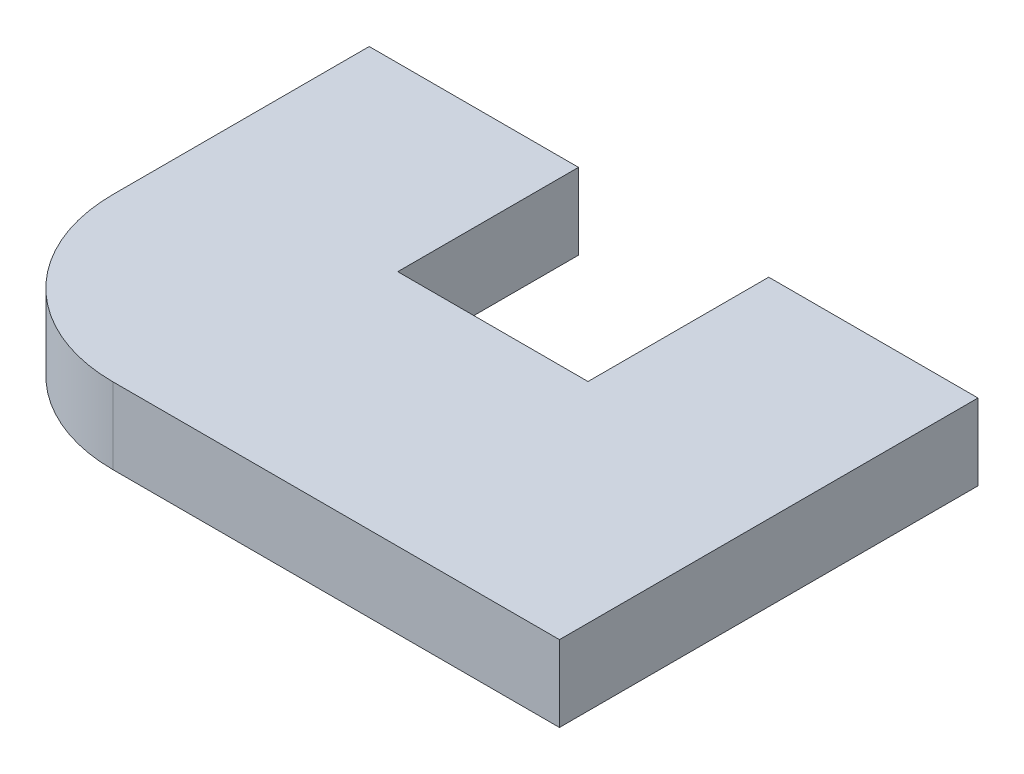
ISO-10303-21;
HEADER;
FILE_DESCRIPTION(('STEP AP214'),'2;1');
FILE_NAME('part.step','',(''),(''),'','','');
FILE_SCHEMA(('AUTOMOTIVE_DESIGN { 1 0 10303 214 1 1 1 1 }'));
ENDSEC;
DATA;
#1=APPLICATION_CONTEXT('core data for automotive mechanical design processes');
#2=APPLICATION_PROTOCOL_DEFINITION('international standard','automotive_design',2000,#1);
#3=PRODUCT_CONTEXT('',#1,'mechanical');
#4=PRODUCT('Part','Part','',(#3));
#5=PRODUCT_RELATED_PRODUCT_CATEGORY('part','',(#4));
#6=PRODUCT_DEFINITION_FORMATION('','',#4);
#7=PRODUCT_DEFINITION_CONTEXT('part definition',#1,'design');
#8=PRODUCT_DEFINITION('design','',#6,#7);
#9=PRODUCT_DEFINITION_SHAPE('','',#8);
#10=(LENGTH_UNIT() NAMED_UNIT(*) SI_UNIT(.MILLI.,.METRE.));
#11=(NAMED_UNIT(*) PLANE_ANGLE_UNIT() SI_UNIT($,.RADIAN.));
#12=(NAMED_UNIT(*) SI_UNIT($,.STERADIAN.) SOLID_ANGLE_UNIT());
#13=UNCERTAINTY_MEASURE_WITH_UNIT(LENGTH_MEASURE(1.E-05),#10,'distance_accuracy_value','');
#14=(GEOMETRIC_REPRESENTATION_CONTEXT(3) GLOBAL_UNCERTAINTY_ASSIGNED_CONTEXT((#13)) GLOBAL_UNIT_ASSIGNED_CONTEXT((#10,
#11,#12)) REPRESENTATION_CONTEXT('',''));
#15=CARTESIAN_POINT('',(0.,0.,0.));
#16=DIRECTION('',(0.,0.,1.));
#17=DIRECTION('',(1.,0.,0.));
#18=AXIS2_PLACEMENT_3D('',#15,#16,#17);
#19=CARTESIAN_POINT('',(30.3553390593274,40.,24.6446609406726));
#20=DIRECTION('',(0.,-1.,0.));
#21=DIRECTION('',(0.,0.,-1.));
#22=AXIS2_PLACEMENT_3D('',#19,#20,#21);
#23=CYLINDRICAL_SURFACE('',#22,85.3553390593274);
#24=CARTESIAN_POINT('',(30.3553390593274,0.,24.6446609406726));
#25=DIRECTION('',(0.,1.,0.));
#26=DIRECTION('',(0.,0.,1.));
#27=AXIS2_PLACEMENT_3D('',#24,#25,#26);
#28=CIRCLE('',#27,85.3553390593274);
#29=CARTESIAN_POINT('',(30.3553390593274,0.,110.));
#30=VERTEX_POINT('',#29);
#31=CARTESIAN_POINT('',(-55.,0.,24.6446609406726));
#32=VERTEX_POINT('',#31);
#33=EDGE_CURVE('E146',#30,#32,#28,.F.);
#34=ORIENTED_EDGE('',*,*,#33,.F.);
#35=DIRECTION('',(0.,-1.,0.));
#36=VECTOR('',#35,1.);
#37=CARTESIAN_POINT('',(30.3553390593274,40.,110.));
#38=LINE('',#37,#36);
#39=CARTESIAN_POINT('',(30.3553390593274,40.,110.));
#40=VERTEX_POINT('',#39);
#41=EDGE_CURVE('E11',#40,#30,#38,.T.);
#42=ORIENTED_EDGE('',*,*,#41,.F.);
#43=CARTESIAN_POINT('',(30.3553390593274,40.,24.6446609406726));
#44=DIRECTION('',(0.,1.,0.));
#45=DIRECTION('',(0.,0.,1.));
#46=AXIS2_PLACEMENT_3D('',#43,#44,#45);
#47=CIRCLE('',#46,85.3553390593274);
#48=CARTESIAN_POINT('',(-55.,40.,24.6446609406726));
#49=VERTEX_POINT('',#48);
#50=EDGE_CURVE('E168',#40,#49,#47,.F.);
#51=ORIENTED_EDGE('',*,*,#50,.T.);
#52=DIRECTION('',(0.,-1.,0.));
#53=VECTOR('',#52,1.);
#54=CARTESIAN_POINT('',(-55.,40.,24.6446609406726));
#55=LINE('',#54,#53);
#56=EDGE_CURVE('E62',#49,#32,#55,.T.);
#57=ORIENTED_EDGE('',*,*,#56,.T.);
#58=EDGE_LOOP('',(#34,#42,#51,#57));
#59=FACE_BOUND('',#58,.T.);
#60=ADVANCED_FACE('F46',(#59),#23,.T.);
#61=CARTESIAN_POINT('',(0.,40.,110.));
#62=DIRECTION('',(0.,0.,-1.));
#63=DIRECTION('',(-1.,0.,0.));
#64=AXIS2_PLACEMENT_3D('',#61,#62,#63);
#65=PLANE('',#64);
#66=DIRECTION('',(1.,0.,0.));
#67=VECTOR('',#66,1.);
#68=CARTESIAN_POINT('',(0.,0.,110.));
#69=LINE('',#68,#67);
#70=CARTESIAN_POINT('',(265.,0.,110.));
#71=VERTEX_POINT('',#70);
#72=EDGE_CURVE('E148',#30,#71,#69,.T.);
#73=ORIENTED_EDGE('',*,*,#72,.T.);
#74=DIRECTION('',(0.,-1.,0.));
#75=VECTOR('',#74,1.);
#76=CARTESIAN_POINT('',(265.,40.,110.));
#77=LINE('',#76,#75);
#78=CARTESIAN_POINT('',(265.,40.,110.));
#79=VERTEX_POINT('',#78);
#80=EDGE_CURVE('E54',#79,#71,#77,.T.);
#81=ORIENTED_EDGE('',*,*,#80,.F.);
#82=DIRECTION('',(1.,0.,0.));
#83=VECTOR('',#82,1.);
#84=CARTESIAN_POINT('',(0.,40.,110.));
#85=LINE('',#84,#83);
#86=EDGE_CURVE('E200',#40,#79,#85,.T.);
#87=ORIENTED_EDGE('',*,*,#86,.F.);
#88=ORIENTED_EDGE('',*,*,#41,.T.);
#89=EDGE_LOOP('',(#73,#81,#87,#88));
#90=FACE_BOUND('',#89,.T.);
#91=ADVANCED_FACE('F217',(#90),#65,.F.);
#92=CARTESIAN_POINT('',(265.,40.,0.));
#93=DIRECTION('',(-1.,0.,0.));
#94=DIRECTION('',(0.,0.,1.));
#95=AXIS2_PLACEMENT_3D('',#92,#93,#94);
#96=PLANE('',#95);
#97=DIRECTION('',(0.,0.,-1.));
#98=VECTOR('',#97,1.);
#99=CARTESIAN_POINT('',(265.,0.,0.));
#100=LINE('',#99,#98);
#101=CARTESIAN_POINT('',(265.,0.,-110.));
#102=VERTEX_POINT('',#101);
#103=EDGE_CURVE('E150',#71,#102,#100,.T.);
#104=ORIENTED_EDGE('',*,*,#103,.T.);
#105=DIRECTION('',(0.,-1.,0.));
#106=VECTOR('',#105,1.);
#107=CARTESIAN_POINT('',(265.,40.,-110.));
#108=LINE('',#107,#106);
#109=CARTESIAN_POINT('',(265.,40.,-110.));
#110=VERTEX_POINT('',#109);
#111=EDGE_CURVE('E176',#110,#102,#108,.T.);
#112=ORIENTED_EDGE('',*,*,#111,.F.);
#113=DIRECTION('',(0.,0.,-1.));
#114=VECTOR('',#113,1.);
#115=CARTESIAN_POINT('',(265.,40.,0.));
#116=LINE('',#115,#114);
#117=EDGE_CURVE('E184',#79,#110,#116,.T.);
#118=ORIENTED_EDGE('',*,*,#117,.F.);
#119=ORIENTED_EDGE('',*,*,#80,.T.);
#120=EDGE_LOOP('',(#104,#112,#118,#119));
#121=FACE_BOUND('',#120,.T.);
#122=ADVANCED_FACE('F182',(#121),#96,.F.);
#123=CARTESIAN_POINT('',(0.,40.,-110.));
#124=DIRECTION('',(0.,0.,-1.));
#125=DIRECTION('',(-1.,0.,0.));
#126=AXIS2_PLACEMENT_3D('',#123,#124,#125);
#127=PLANE('',#126);
#128=DIRECTION('',(1.,0.,0.));
#129=VECTOR('',#128,1.);
#130=CARTESIAN_POINT('',(0.,0.,-110.));
#131=LINE('',#130,#129);
#132=CARTESIAN_POINT('',(155.,0.,-110.));
#133=VERTEX_POINT('',#132);
#134=EDGE_CURVE('E153',#133,#102,#131,.T.);
#135=ORIENTED_EDGE('',*,*,#134,.F.);
#136=DIRECTION('',(0.,-1.,0.));
#137=VECTOR('',#136,1.);
#138=CARTESIAN_POINT('',(155.,40.,-110.));
#139=LINE('',#138,#137);
#140=CARTESIAN_POINT('',(155.,40.,-110.));
#141=VERTEX_POINT('',#140);
#142=EDGE_CURVE('E174',#141,#133,#139,.T.);
#143=ORIENTED_EDGE('',*,*,#142,.F.);
#144=DIRECTION('',(1.,0.,0.));
#145=VECTOR('',#144,1.);
#146=CARTESIAN_POINT('',(0.,40.,-110.));
#147=LINE('',#146,#145);
#148=EDGE_CURVE('E195',#141,#110,#147,.T.);
#149=ORIENTED_EDGE('',*,*,#148,.T.);
#150=ORIENTED_EDGE('',*,*,#111,.T.);
#151=EDGE_LOOP('',(#135,#143,#149,#150));
#152=FACE_BOUND('',#151,.T.);
#153=ADVANCED_FACE('F192',(#152),#127,.T.);
#154=CARTESIAN_POINT('',(155.,40.,0.));
#155=DIRECTION('',(-1.,0.,0.));
#156=DIRECTION('',(0.,0.,1.));
#157=AXIS2_PLACEMENT_3D('',#154,#155,#156);
#158=PLANE('',#157);
#159=DIRECTION('',(0.,0.,-1.));
#160=VECTOR('',#159,1.);
#161=CARTESIAN_POINT('',(155.,0.,0.));
#162=LINE('',#161,#160);
#163=CARTESIAN_POINT('',(155.,0.,-15.));
#164=VERTEX_POINT('',#163);
#165=EDGE_CURVE('E156',#164,#133,#162,.T.);
#166=ORIENTED_EDGE('',*,*,#165,.F.);
#167=DIRECTION('',(0.,-1.,0.));
#168=VECTOR('',#167,1.);
#169=CARTESIAN_POINT('',(155.,40.,-15.));
#170=LINE('',#169,#168);
#171=CARTESIAN_POINT('',(155.,40.,-15.));
#172=VERTEX_POINT('',#171);
#173=EDGE_CURVE('E172',#172,#164,#170,.T.);
#174=ORIENTED_EDGE('',*,*,#173,.F.);
#175=DIRECTION('',(0.,0.,-1.));
#176=VECTOR('',#175,1.);
#177=CARTESIAN_POINT('',(155.,40.,0.));
#178=LINE('',#177,#176);
#179=EDGE_CURVE('E197',#172,#141,#178,.T.);
#180=ORIENTED_EDGE('',*,*,#179,.T.);
#181=ORIENTED_EDGE('',*,*,#142,.T.);
#182=EDGE_LOOP('',(#166,#174,#180,#181));
#183=FACE_BOUND('',#182,.T.);
#184=ADVANCED_FACE('F228',(#183),#158,.T.);
#185=CARTESIAN_POINT('',(0.,40.,-15.));
#186=DIRECTION('',(0.,0.,-1.));
#187=DIRECTION('',(-1.,0.,0.));
#188=AXIS2_PLACEMENT_3D('',#185,#186,#187);
#189=PLANE('',#188);
#190=DIRECTION('',(1.,0.,0.));
#191=VECTOR('',#190,1.);
#192=CARTESIAN_POINT('',(0.,0.,-15.));
#193=LINE('',#192,#191);
#194=CARTESIAN_POINT('',(55.,0.,-15.));
#195=VERTEX_POINT('',#194);
#196=EDGE_CURVE('E159',#195,#164,#193,.T.);
#197=ORIENTED_EDGE('',*,*,#196,.F.);
#198=DIRECTION('',(0.,-1.,0.));
#199=VECTOR('',#198,1.);
#200=CARTESIAN_POINT('',(55.,40.,-15.));
#201=LINE('',#200,#199);
#202=CARTESIAN_POINT('',(55.,40.,-15.));
#203=VERTEX_POINT('',#202);
#204=EDGE_CURVE('E138',#203,#195,#201,.T.);
#205=ORIENTED_EDGE('',*,*,#204,.F.);
#206=DIRECTION('',(1.,0.,0.));
#207=VECTOR('',#206,1.);
#208=CARTESIAN_POINT('',(0.,40.,-15.));
#209=LINE('',#208,#207);
#210=EDGE_CURVE('E128',#203,#172,#209,.T.);
#211=ORIENTED_EDGE('',*,*,#210,.T.);
#212=ORIENTED_EDGE('',*,*,#173,.T.);
#213=EDGE_LOOP('',(#197,#205,#211,#212));
#214=FACE_BOUND('',#213,.T.);
#215=ADVANCED_FACE('F205',(#214),#189,.T.);
#216=CARTESIAN_POINT('',(55.,40.,0.));
#217=DIRECTION('',(-1.,0.,0.));
#218=DIRECTION('',(0.,0.,1.));
#219=AXIS2_PLACEMENT_3D('',#216,#217,#218);
#220=PLANE('',#219);
#221=DIRECTION('',(0.,0.,-1.));
#222=VECTOR('',#221,1.);
#223=CARTESIAN_POINT('',(55.,0.,0.));
#224=LINE('',#223,#222);
#225=CARTESIAN_POINT('',(55.,0.,-110.));
#226=VERTEX_POINT('',#225);
#227=EDGE_CURVE('E135',#195,#226,#224,.T.);
#228=ORIENTED_EDGE('',*,*,#227,.T.);
#229=DIRECTION('',(0.,-1.,0.));
#230=VECTOR('',#229,1.);
#231=CARTESIAN_POINT('',(55.,40.,-110.));
#232=LINE('',#231,#230);
#233=CARTESIAN_POINT('',(55.,40.,-110.));
#234=VERTEX_POINT('',#233);
#235=EDGE_CURVE('E132',#234,#226,#232,.T.);
#236=ORIENTED_EDGE('',*,*,#235,.F.);
#237=DIRECTION('',(0.,0.,-1.));
#238=VECTOR('',#237,1.);
#239=CARTESIAN_POINT('',(55.,40.,0.));
#240=LINE('',#239,#238);
#241=EDGE_CURVE('E119',#203,#234,#240,.T.);
#242=ORIENTED_EDGE('',*,*,#241,.F.);
#243=ORIENTED_EDGE('',*,*,#204,.T.);
#244=EDGE_LOOP('',(#228,#236,#242,#243));
#245=FACE_BOUND('',#244,.T.);
#246=ADVANCED_FACE('F133',(#245),#220,.F.);
#247=CARTESIAN_POINT('',(0.,40.,-110.));
#248=DIRECTION('',(0.,0.,-1.));
#249=DIRECTION('',(-1.,0.,0.));
#250=AXIS2_PLACEMENT_3D('',#247,#248,#249);
#251=PLANE('',#250);
#252=DIRECTION('',(1.,0.,0.));
#253=VECTOR('',#252,1.);
#254=CARTESIAN_POINT('',(0.,0.,-110.));
#255=LINE('',#254,#253);
#256=CARTESIAN_POINT('',(-55.,0.,-110.));
#257=VERTEX_POINT('',#256);
#258=EDGE_CURVE('E163',#257,#226,#255,.T.);
#259=ORIENTED_EDGE('',*,*,#258,.F.);
#260=DIRECTION('',(0.,-1.,0.));
#261=VECTOR('',#260,1.);
#262=CARTESIAN_POINT('',(-55.,40.,-110.));
#263=LINE('',#262,#261);
#264=CARTESIAN_POINT('',(-55.,40.,-110.));
#265=VERTEX_POINT('',#264);
#266=EDGE_CURVE('E90',#265,#257,#263,.T.);
#267=ORIENTED_EDGE('',*,*,#266,.F.);
#268=DIRECTION('',(1.,0.,0.));
#269=VECTOR('',#268,1.);
#270=CARTESIAN_POINT('',(0.,40.,-110.));
#271=LINE('',#270,#269);
#272=EDGE_CURVE('E125',#265,#234,#271,.T.);
#273=ORIENTED_EDGE('',*,*,#272,.T.);
#274=ORIENTED_EDGE('',*,*,#235,.T.);
#275=EDGE_LOOP('',(#259,#267,#273,#274));
#276=FACE_BOUND('',#275,.T.);
#277=ADVANCED_FACE('F140',(#276),#251,.T.);
#278=CARTESIAN_POINT('',(-55.,40.,0.));
#279=DIRECTION('',(-1.,0.,0.));
#280=DIRECTION('',(0.,0.,1.));
#281=AXIS2_PLACEMENT_3D('',#278,#279,#280);
#282=PLANE('',#281);
#283=DIRECTION('',(0.,0.,-1.));
#284=VECTOR('',#283,1.);
#285=CARTESIAN_POINT('',(-55.,0.,0.));
#286=LINE('',#285,#284);
#287=EDGE_CURVE('E165',#32,#257,#286,.T.);
#288=ORIENTED_EDGE('',*,*,#287,.F.);
#289=ORIENTED_EDGE('',*,*,#56,.F.);
#290=DIRECTION('',(0.,0.,-1.));
#291=VECTOR('',#290,1.);
#292=CARTESIAN_POINT('',(-55.,40.,0.));
#293=LINE('',#292,#291);
#294=EDGE_CURVE('E141',#49,#265,#293,.T.);
#295=ORIENTED_EDGE('',*,*,#294,.T.);
#296=ORIENTED_EDGE('',*,*,#266,.T.);
#297=EDGE_LOOP('',(#288,#289,#295,#296));
#298=FACE_BOUND('',#297,.T.);
#299=ADVANCED_FACE('F206',(#298),#282,.T.);
#300=CARTESIAN_POINT('',(0.,40.,0.));
#301=DIRECTION('',(0.,1.,0.));
#302=DIRECTION('',(0.,0.,1.));
#303=AXIS2_PLACEMENT_3D('',#300,#301,#302);
#304=PLANE('',#303);
#305=ORIENTED_EDGE('',*,*,#50,.F.);
#306=ORIENTED_EDGE('',*,*,#86,.T.);
#307=ORIENTED_EDGE('',*,*,#117,.T.);
#308=ORIENTED_EDGE('',*,*,#148,.F.);
#309=ORIENTED_EDGE('',*,*,#179,.F.);
#310=ORIENTED_EDGE('',*,*,#210,.F.);
#311=ORIENTED_EDGE('',*,*,#241,.T.);
#312=ORIENTED_EDGE('',*,*,#272,.F.);
#313=ORIENTED_EDGE('',*,*,#294,.F.);
#314=EDGE_LOOP('',(#305,#306,#307,#308,#309,#310,#311,#312,#313));
#315=FACE_BOUND('',#314,.T.);
#316=ADVANCED_FACE('F122',(#315),#304,.T.);
#317=CARTESIAN_POINT('',(0.,0.,0.));
#318=DIRECTION('',(0.,1.,0.));
#319=DIRECTION('',(0.,0.,1.));
#320=AXIS2_PLACEMENT_3D('',#317,#318,#319);
#321=PLANE('',#320);
#322=ORIENTED_EDGE('',*,*,#33,.T.);
#323=ORIENTED_EDGE('',*,*,#287,.T.);
#324=ORIENTED_EDGE('',*,*,#258,.T.);
#325=ORIENTED_EDGE('',*,*,#227,.F.);
#326=ORIENTED_EDGE('',*,*,#196,.T.);
#327=ORIENTED_EDGE('',*,*,#165,.T.);
#328=ORIENTED_EDGE('',*,*,#134,.T.);
#329=ORIENTED_EDGE('',*,*,#103,.F.);
#330=ORIENTED_EDGE('',*,*,#72,.F.);
#331=EDGE_LOOP('',(#322,#323,#324,#325,#326,#327,#328,#329,#330));
#332=FACE_BOUND('',#331,.T.);
#333=ADVANCED_FACE('F188',(#332),#321,.F.);
#334=CLOSED_SHELL('',(#60,#91,#122,#153,#184,#215,#246,#277,#299,#316,#333));
#335=MANIFOLD_SOLID_BREP('B2',#334);
#336=ADVANCED_BREP_SHAPE_REPRESENTATION('',(#18,#335),#14);
#337=SHAPE_DEFINITION_REPRESENTATION(#9,#336);
ENDSEC;
END-ISO-10303-21;
